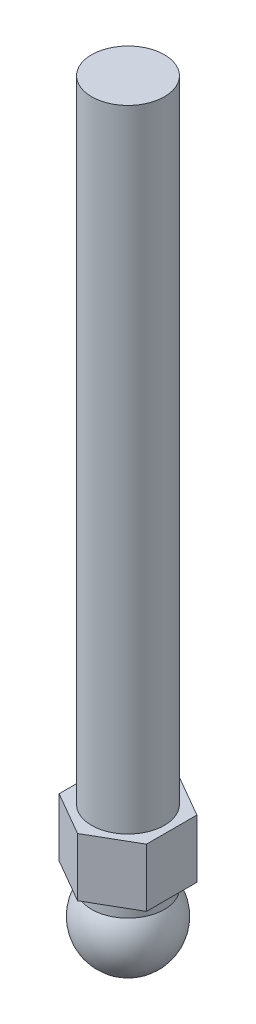
ISO-10303-21;
HEADER;
FILE_DESCRIPTION(('STEP AP214'),'2;1');
FILE_NAME('part.step','',(''),(''),'','','');
FILE_SCHEMA(('AUTOMOTIVE_DESIGN { 1 0 10303 214 1 1 1 1 }'));
ENDSEC;
DATA;
#1=APPLICATION_CONTEXT('core data for automotive mechanical design processes');
#2=APPLICATION_PROTOCOL_DEFINITION('international standard','automotive_design',2000,#1);
#3=PRODUCT_CONTEXT('',#1,'mechanical');
#4=PRODUCT('Part','Part','',(#3));
#5=PRODUCT_RELATED_PRODUCT_CATEGORY('part','',(#4));
#6=PRODUCT_DEFINITION_FORMATION('','',#4);
#7=PRODUCT_DEFINITION_CONTEXT('part definition',#1,'design');
#8=PRODUCT_DEFINITION('design','',#6,#7);
#9=PRODUCT_DEFINITION_SHAPE('','',#8);
#10=(LENGTH_UNIT() NAMED_UNIT(*) SI_UNIT(.MILLI.,.METRE.));
#11=(NAMED_UNIT(*) PLANE_ANGLE_UNIT() SI_UNIT($,.RADIAN.));
#12=(NAMED_UNIT(*) SI_UNIT($,.STERADIAN.) SOLID_ANGLE_UNIT());
#13=UNCERTAINTY_MEASURE_WITH_UNIT(LENGTH_MEASURE(1.E-05),#10,'distance_accuracy_value','');
#14=(GEOMETRIC_REPRESENTATION_CONTEXT(3) GLOBAL_UNCERTAINTY_ASSIGNED_CONTEXT((#13)) GLOBAL_UNIT_ASSIGNED_CONTEXT((#10,
#11,#12)) REPRESENTATION_CONTEXT('',''));
#15=CARTESIAN_POINT('',(0.,0.,0.));
#16=DIRECTION('',(0.,0.,1.));
#17=DIRECTION('',(1.,0.,0.));
#18=AXIS2_PLACEMENT_3D('',#15,#16,#17);
#19=CARTESIAN_POINT('',(-4.99999999999999,100.,0.));
#20=DIRECTION('',(0.,1.,0.));
#21=DIRECTION('',(0.,0.,1.));
#22=AXIS2_PLACEMENT_3D('',#19,#20,#21);
#23=PLANE('',#22);
#24=CARTESIAN_POINT('',(0.,100.,0.));
#25=DIRECTION('',(0.,1.,0.));
#26=DIRECTION('',(0.,0.,1.));
#27=AXIS2_PLACEMENT_3D('',#24,#25,#26);
#28=CIRCLE('',#27,4.99999999999999);
#29=CARTESIAN_POINT('',(0.,100.,4.99999999999999));
#30=VERTEX_POINT('',#29);
#31=EDGE_CURVE('E45',#30,#30,#28,.T.);
#32=ORIENTED_EDGE('',*,*,#31,.T.);
#33=EDGE_LOOP('',(#32));
#34=FACE_BOUND('',#33,.T.);
#35=ADVANCED_FACE('F36',(#34),#23,.T.);
#36=CARTESIAN_POINT('',(0.,109.494581108005,0.));
#37=DIRECTION('',(0.,1.,0.));
#38=DIRECTION('',(0.,0.,1.));
#39=AXIS2_PLACEMENT_3D('',#36,#37,#38);
#40=CYLINDRICAL_SURFACE('',#39,4.99999999999999);
#41=CARTESIAN_POINT('',(0.,13.3166247903554,0.));
#42=DIRECTION('',(0.,1.,0.));
#43=DIRECTION('',(0.,0.,1.));
#44=AXIS2_PLACEMENT_3D('',#41,#42,#43);
#45=CIRCLE('',#44,4.99999999999999);
#46=CARTESIAN_POINT('',(0.,13.3166247903554,4.99999999999999));
#47=VERTEX_POINT('',#46);
#48=EDGE_CURVE('E11',#47,#47,#45,.F.);
#49=ORIENTED_EDGE('',*,*,#48,.F.);
#50=EDGE_LOOP('',(#49));
#51=FACE_BOUND('',#50,.T.);
#52=ORIENTED_EDGE('',*,*,#31,.F.);
#53=EDGE_LOOP('',(#52));
#54=FACE_BOUND('',#53,.T.);
#55=ADVANCED_FACE('F172',(#51,#54),#40,.T.);
#56=CARTESIAN_POINT('',(6.,13.3166247903554,-3.46410161513775));
#57=DIRECTION('',(-0.5,0.,0.866025403784439));
#58=DIRECTION('',(0.866025403784439,0.,0.5));
#59=AXIS2_PLACEMENT_3D('',#56,#57,#58);
#60=PLANE('',#59);
#61=DIRECTION('',(-0.866025403784439,0.,-0.5));
#62=VECTOR('',#61,1.);
#63=CARTESIAN_POINT('',(6.,5.31662479035542,-3.46410161513775));
#64=LINE('',#63,#62);
#65=CARTESIAN_POINT('',(6.,5.31662479035542,-3.46410161513775));
#66=VERTEX_POINT('',#65);
#67=CARTESIAN_POINT('',(0.,5.31662479035542,-6.92820323027551));
#68=VERTEX_POINT('',#67);
#69=EDGE_CURVE('E122',#66,#68,#64,.T.);
#70=ORIENTED_EDGE('',*,*,#69,.T.);
#71=DIRECTION('',(0.,-1.,0.));
#72=VECTOR('',#71,1.);
#73=CARTESIAN_POINT('',(0.,13.3166247903554,-6.92820323027551));
#74=LINE('',#73,#72);
#75=CARTESIAN_POINT('',(0.,13.3166247903554,-6.92820323027551));
#76=VERTEX_POINT('',#75);
#77=EDGE_CURVE('E139',#76,#68,#74,.T.);
#78=ORIENTED_EDGE('',*,*,#77,.F.);
#79=DIRECTION('',(-0.866025403784439,0.,-0.5));
#80=VECTOR('',#79,1.);
#81=CARTESIAN_POINT('',(6.,13.3166247903554,-3.46410161513775));
#82=LINE('',#81,#80);
#83=CARTESIAN_POINT('',(6.,13.3166247903554,-3.46410161513775));
#84=VERTEX_POINT('',#83);
#85=EDGE_CURVE('E132',#84,#76,#82,.T.);
#86=ORIENTED_EDGE('',*,*,#85,.F.);
#87=DIRECTION('',(0.,-1.,0.));
#88=VECTOR('',#87,1.);
#89=CARTESIAN_POINT('',(6.,13.3166247903554,-3.46410161513775));
#90=LINE('',#89,#88);
#91=EDGE_CURVE('E118',#84,#66,#90,.T.);
#92=ORIENTED_EDGE('',*,*,#91,.T.);
#93=EDGE_LOOP('',(#70,#78,#86,#92));
#94=FACE_BOUND('',#93,.T.);
#95=ADVANCED_FACE('F159',(#94),#60,.F.);
#96=CARTESIAN_POINT('',(0.,13.3166247903554,-6.92820323027551));
#97=DIRECTION('',(0.5,0.,0.866025403784439));
#98=DIRECTION('',(0.866025403784439,0.,-0.5));
#99=AXIS2_PLACEMENT_3D('',#96,#97,#98);
#100=PLANE('',#99);
#101=DIRECTION('',(-0.866025403784439,0.,0.5));
#102=VECTOR('',#101,1.);
#103=CARTESIAN_POINT('',(0.,5.31662479035542,-6.92820323027551));
#104=LINE('',#103,#102);
#105=CARTESIAN_POINT('',(-6.,5.31662479035542,-3.46410161513776));
#106=VERTEX_POINT('',#105);
#107=EDGE_CURVE('E125',#68,#106,#104,.T.);
#108=ORIENTED_EDGE('',*,*,#107,.T.);
#109=DIRECTION('',(0.,-1.,0.));
#110=VECTOR('',#109,1.);
#111=CARTESIAN_POINT('',(-6.,13.3166247903554,-3.46410161513776));
#112=LINE('',#111,#110);
#113=CARTESIAN_POINT('',(-6.,13.3166247903554,-3.46410161513776));
#114=VERTEX_POINT('',#113);
#115=EDGE_CURVE('E136',#114,#106,#112,.T.);
#116=ORIENTED_EDGE('',*,*,#115,.F.);
#117=DIRECTION('',(-0.866025403784439,0.,0.5));
#118=VECTOR('',#117,1.);
#119=CARTESIAN_POINT('',(0.,13.3166247903554,-6.92820323027551));
#120=LINE('',#119,#118);
#121=EDGE_CURVE('E91',#76,#114,#120,.T.);
#122=ORIENTED_EDGE('',*,*,#121,.F.);
#123=ORIENTED_EDGE('',*,*,#77,.T.);
#124=EDGE_LOOP('',(#108,#116,#122,#123));
#125=FACE_BOUND('',#124,.T.);
#126=ADVANCED_FACE('F182',(#125),#100,.F.);
#127=CARTESIAN_POINT('',(-6.,13.3166247903554,-3.46410161513776));
#128=DIRECTION('',(1.,0.,0.));
#129=DIRECTION('',(0.,0.,-1.));
#130=AXIS2_PLACEMENT_3D('',#127,#128,#129);
#131=PLANE('',#130);
#132=DIRECTION('',(0.,0.,1.));
#133=VECTOR('',#132,1.);
#134=CARTESIAN_POINT('',(-6.,5.31662479035542,-3.46410161513776));
#135=LINE('',#134,#133);
#136=CARTESIAN_POINT('',(-6.,5.31662479035542,3.46410161513775));
#137=VERTEX_POINT('',#136);
#138=EDGE_CURVE('E127',#106,#137,#135,.T.);
#139=ORIENTED_EDGE('',*,*,#138,.T.);
#140=DIRECTION('',(0.,-1.,0.));
#141=VECTOR('',#140,1.);
#142=CARTESIAN_POINT('',(-6.,13.3166247903554,3.46410161513775));
#143=LINE('',#142,#141);
#144=CARTESIAN_POINT('',(-6.,13.3166247903554,3.46410161513775));
#145=VERTEX_POINT('',#144);
#146=EDGE_CURVE('E113',#145,#137,#143,.T.);
#147=ORIENTED_EDGE('',*,*,#146,.F.);
#148=DIRECTION('',(0.,0.,1.));
#149=VECTOR('',#148,1.);
#150=CARTESIAN_POINT('',(-6.,13.3166247903554,-3.46410161513776));
#151=LINE('',#150,#149);
#152=EDGE_CURVE('E104',#114,#145,#151,.T.);
#153=ORIENTED_EDGE('',*,*,#152,.F.);
#154=ORIENTED_EDGE('',*,*,#115,.T.);
#155=EDGE_LOOP('',(#139,#147,#153,#154));
#156=FACE_BOUND('',#155,.T.);
#157=ADVANCED_FACE('F185',(#156),#131,.F.);
#158=CARTESIAN_POINT('',(-6.,13.3166247903554,3.46410161513775));
#159=DIRECTION('',(0.5,0.,-0.866025403784439));
#160=DIRECTION('',(-0.866025403784439,0.,-0.5));
#161=AXIS2_PLACEMENT_3D('',#158,#159,#160);
#162=PLANE('',#161);
#163=DIRECTION('',(0.866025403784439,0.,0.5));
#164=VECTOR('',#163,1.);
#165=CARTESIAN_POINT('',(-6.,5.31662479035542,3.46410161513775));
#166=LINE('',#165,#164);
#167=CARTESIAN_POINT('',(0.,5.31662479035542,6.92820323027551));
#168=VERTEX_POINT('',#167);
#169=EDGE_CURVE('E112',#137,#168,#166,.T.);
#170=ORIENTED_EDGE('',*,*,#169,.T.);
#171=DIRECTION('',(0.,-1.,0.));
#172=VECTOR('',#171,1.);
#173=CARTESIAN_POINT('',(0.,13.3166247903554,6.92820323027551));
#174=LINE('',#173,#172);
#175=CARTESIAN_POINT('',(0.,13.3166247903554,6.92820323027551));
#176=VERTEX_POINT('',#175);
#177=EDGE_CURVE('E109',#176,#168,#174,.T.);
#178=ORIENTED_EDGE('',*,*,#177,.F.);
#179=DIRECTION('',(0.866025403784439,0.,0.5));
#180=VECTOR('',#179,1.);
#181=CARTESIAN_POINT('',(-6.,13.3166247903554,3.46410161513775));
#182=LINE('',#181,#180);
#183=EDGE_CURVE('E98',#145,#176,#182,.T.);
#184=ORIENTED_EDGE('',*,*,#183,.F.);
#185=ORIENTED_EDGE('',*,*,#146,.T.);
#186=EDGE_LOOP('',(#170,#178,#184,#185));
#187=FACE_BOUND('',#186,.T.);
#188=ADVANCED_FACE('F110',(#187),#162,.F.);
#189=CARTESIAN_POINT('',(0.,13.3166247903554,6.92820323027551));
#190=DIRECTION('',(-0.5,0.,-0.866025403784439));
#191=DIRECTION('',(-0.866025403784439,0.,0.5));
#192=AXIS2_PLACEMENT_3D('',#189,#190,#191);
#193=PLANE('',#192);
#194=DIRECTION('',(0.866025403784439,0.,-0.5));
#195=VECTOR('',#194,1.);
#196=CARTESIAN_POINT('',(0.,5.31662479035542,6.92820323027551));
#197=LINE('',#196,#195);
#198=CARTESIAN_POINT('',(6.,5.31662479035542,3.46410161513776));
#199=VERTEX_POINT('',#198);
#200=EDGE_CURVE('E76',#168,#199,#197,.T.);
#201=ORIENTED_EDGE('',*,*,#200,.T.);
#202=DIRECTION('',(0.,-1.,0.));
#203=VECTOR('',#202,1.);
#204=CARTESIAN_POINT('',(6.,13.3166247903554,3.46410161513776));
#205=LINE('',#204,#203);
#206=CARTESIAN_POINT('',(6.,13.3166247903554,3.46410161513776));
#207=VERTEX_POINT('',#206);
#208=EDGE_CURVE('E114',#207,#199,#205,.T.);
#209=ORIENTED_EDGE('',*,*,#208,.F.);
#210=DIRECTION('',(0.866025403784439,0.,-0.5));
#211=VECTOR('',#210,1.);
#212=CARTESIAN_POINT('',(0.,13.3166247903554,6.92820323027551));
#213=LINE('',#212,#211);
#214=EDGE_CURVE('E102',#176,#207,#213,.T.);
#215=ORIENTED_EDGE('',*,*,#214,.F.);
#216=ORIENTED_EDGE('',*,*,#177,.T.);
#217=EDGE_LOOP('',(#201,#209,#215,#216));
#218=FACE_BOUND('',#217,.T.);
#219=ADVANCED_FACE('F116',(#218),#193,.F.);
#220=CARTESIAN_POINT('',(6.,13.3166247903554,3.46410161513776));
#221=DIRECTION('',(-1.,0.,0.));
#222=DIRECTION('',(0.,0.,1.));
#223=AXIS2_PLACEMENT_3D('',#220,#221,#222);
#224=PLANE('',#223);
#225=DIRECTION('',(0.,0.,-1.));
#226=VECTOR('',#225,1.);
#227=CARTESIAN_POINT('',(6.,5.31662479035542,3.46410161513776));
#228=LINE('',#227,#226);
#229=EDGE_CURVE('E82',#199,#66,#228,.T.);
#230=ORIENTED_EDGE('',*,*,#229,.T.);
#231=ORIENTED_EDGE('',*,*,#91,.F.);
#232=DIRECTION('',(0.,0.,-1.));
#233=VECTOR('',#232,1.);
#234=CARTESIAN_POINT('',(6.,13.3166247903554,3.46410161513776));
#235=LINE('',#234,#233);
#236=EDGE_CURVE('E53',#207,#84,#235,.T.);
#237=ORIENTED_EDGE('',*,*,#236,.F.);
#238=ORIENTED_EDGE('',*,*,#208,.T.);
#239=EDGE_LOOP('',(#230,#231,#237,#238));
#240=FACE_BOUND('',#239,.T.);
#241=ADVANCED_FACE('F161',(#240),#224,.F.);
#242=CARTESIAN_POINT('',(0.,13.3166247903554,0.));
#243=DIRECTION('',(0.,1.,0.));
#244=DIRECTION('',(0.,0.,1.));
#245=AXIS2_PLACEMENT_3D('',#242,#243,#244);
#246=PLANE('',#245);
#247=ORIENTED_EDGE('',*,*,#48,.T.);
#248=EDGE_LOOP('',(#247));
#249=FACE_BOUND('',#248,.T.);
#250=ORIENTED_EDGE('',*,*,#85,.T.);
#251=ORIENTED_EDGE('',*,*,#121,.T.);
#252=ORIENTED_EDGE('',*,*,#152,.T.);
#253=ORIENTED_EDGE('',*,*,#183,.T.);
#254=ORIENTED_EDGE('',*,*,#214,.T.);
#255=ORIENTED_EDGE('',*,*,#236,.T.);
#256=EDGE_LOOP('',(#250,#251,#252,#253,#254,#255));
#257=FACE_BOUND('',#256,.T.);
#258=ADVANCED_FACE('F100',(#249,#257),#246,.T.);
#259=CARTESIAN_POINT('',(0.,5.31662479035542,0.));
#260=DIRECTION('',(0.,1.,0.));
#261=DIRECTION('',(0.,0.,1.));
#262=AXIS2_PLACEMENT_3D('',#259,#260,#261);
#263=PLANE('',#262);
#264=CARTESIAN_POINT('',(0.,5.31662479035543,0.));
#265=DIRECTION('',(0.,1.,0.));
#266=DIRECTION('',(0.,0.,1.));
#267=AXIS2_PLACEMENT_3D('',#264,#265,#266);
#268=CIRCLE('',#267,4.99999999999999);
#269=CARTESIAN_POINT('',(0.,5.31662479035543,4.99999999999999));
#270=VERTEX_POINT('',#269);
#271=EDGE_CURVE('E141',#270,#270,#268,.F.);
#272=ORIENTED_EDGE('',*,*,#271,.F.);
#273=EDGE_LOOP('',(#272));
#274=FACE_BOUND('',#273,.T.);
#275=ORIENTED_EDGE('',*,*,#69,.F.);
#276=ORIENTED_EDGE('',*,*,#229,.F.);
#277=ORIENTED_EDGE('',*,*,#200,.F.);
#278=ORIENTED_EDGE('',*,*,#169,.F.);
#279=ORIENTED_EDGE('',*,*,#138,.F.);
#280=ORIENTED_EDGE('',*,*,#107,.F.);
#281=EDGE_LOOP('',(#275,#276,#277,#278,#279,#280));
#282=FACE_BOUND('',#281,.T.);
#283=ADVANCED_FACE('F151',(#274,#282),#263,.F.);
#284=CARTESIAN_POINT('',(0.,0.,0.));
#285=DIRECTION('',(0.,1.,0.));
#286=DIRECTION('',(-1.,0.,0.));
#287=AXIS2_PLACEMENT_3D('',#284,#285,#286);
#288=SPHERICAL_SURFACE('',#287,6.);
#289=CARTESIAN_POINT('',(0.,3.31662479035542,0.));
#290=DIRECTION('',(0.,1.,0.));
#291=DIRECTION('',(0.,0.,1.));
#292=AXIS2_PLACEMENT_3D('',#289,#290,#291);
#293=CIRCLE('',#292,4.99999999999999);
#294=CARTESIAN_POINT('',(0.,3.31662479035542,4.99999999999999));
#295=VERTEX_POINT('',#294);
#296=EDGE_CURVE('E142',#295,#295,#293,.T.);
#297=ORIENTED_EDGE('',*,*,#296,.F.);
#298=EDGE_LOOP('',(#297));
#299=FACE_BOUND('',#298,.T.);
#300=ADVANCED_FACE('F38',(#299),#288,.T.);
#301=ORIENTED_EDGE('',*,*,#296,.T.);
#302=EDGE_LOOP('',(#301));
#303=FACE_BOUND('',#302,.T.);
#304=ORIENTED_EDGE('',*,*,#271,.T.);
#305=EDGE_LOOP('',(#304));
#306=FACE_BOUND('',#305,.T.);
#307=ADVANCED_FACE('F149',(#303,#306),#40,.T.);
#308=CLOSED_SHELL('',(#35,#55,#95,#126,#157,#188,#219,#241,#258,#283,#300,#307));
#309=MANIFOLD_SOLID_BREP('B2',#308);
#310=ADVANCED_BREP_SHAPE_REPRESENTATION('',(#18,#309),#14);
#311=SHAPE_DEFINITION_REPRESENTATION(#9,#310);
ENDSEC;
END-ISO-10303-21;
